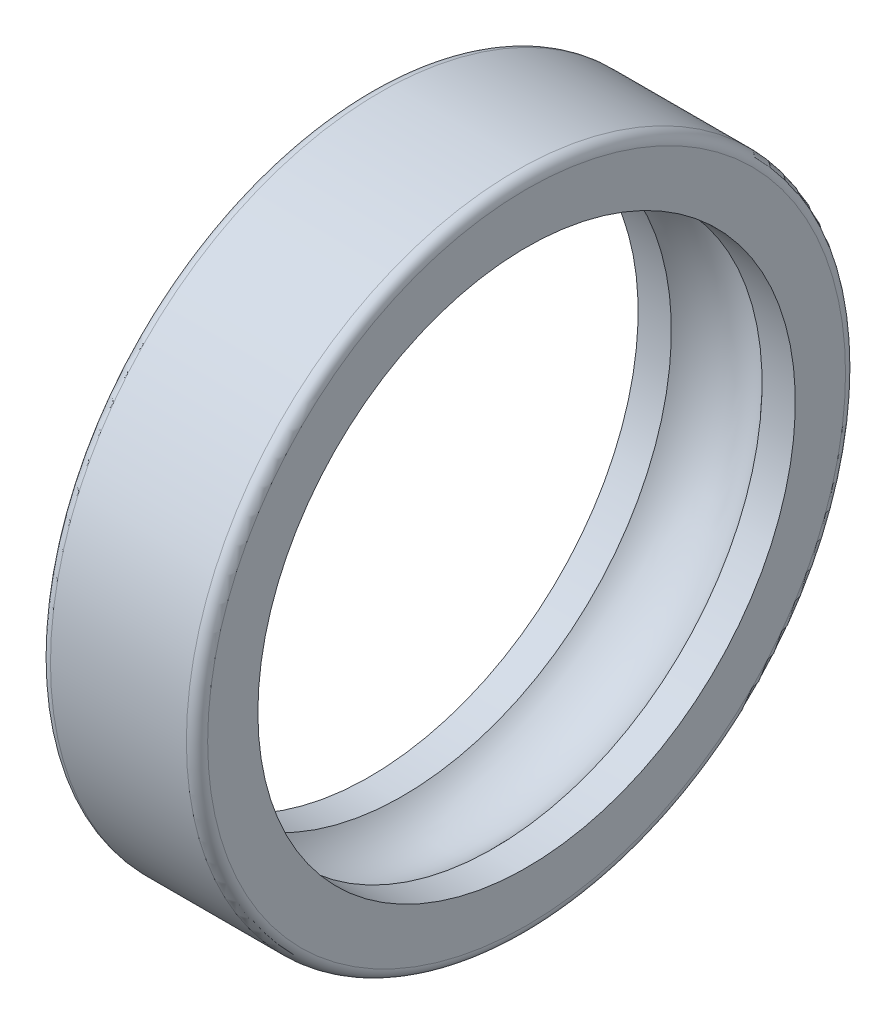
ISO-10303-21;
HEADER;
FILE_DESCRIPTION(('STEP AP214'),'2;1');
FILE_NAME('part.step','',(''),(''),'','','');
FILE_SCHEMA(('AUTOMOTIVE_DESIGN { 1 0 10303 214 1 1 1 1 }'));
ENDSEC;
DATA;
#1=APPLICATION_CONTEXT('core data for automotive mechanical design processes');
#2=APPLICATION_PROTOCOL_DEFINITION('international standard','automotive_design',2000,#1);
#3=PRODUCT_CONTEXT('',#1,'mechanical');
#4=PRODUCT('Part','Part','',(#3));
#5=PRODUCT_RELATED_PRODUCT_CATEGORY('part','',(#4));
#6=PRODUCT_DEFINITION_FORMATION('','',#4);
#7=PRODUCT_DEFINITION_CONTEXT('part definition',#1,'design');
#8=PRODUCT_DEFINITION('design','',#6,#7);
#9=PRODUCT_DEFINITION_SHAPE('','',#8);
#10=(LENGTH_UNIT() NAMED_UNIT(*) SI_UNIT(.MILLI.,.METRE.));
#11=(NAMED_UNIT(*) PLANE_ANGLE_UNIT() SI_UNIT($,.RADIAN.));
#12=(NAMED_UNIT(*) SI_UNIT($,.STERADIAN.) SOLID_ANGLE_UNIT());
#13=UNCERTAINTY_MEASURE_WITH_UNIT(LENGTH_MEASURE(1.E-05),#10,'distance_accuracy_value','');
#14=(GEOMETRIC_REPRESENTATION_CONTEXT(3) GLOBAL_UNCERTAINTY_ASSIGNED_CONTEXT((#13)) GLOBAL_UNIT_ASSIGNED_CONTEXT((#10,
#11,#12)) REPRESENTATION_CONTEXT('',''));
#15=CARTESIAN_POINT('',(0.,0.,0.));
#16=DIRECTION('',(0.,0.,1.));
#17=DIRECTION('',(1.,0.,0.));
#18=AXIS2_PLACEMENT_3D('',#15,#16,#17);
#19=CARTESIAN_POINT('',(-33.1550539901604,0.,0.));
#20=DIRECTION('',(-1.,0.,0.));
#21=DIRECTION('',(0.,0.,1.));
#22=AXIS2_PLACEMENT_3D('',#19,#20,#21);
#23=CYLINDRICAL_SURFACE('',#22,53.);
#24=CARTESIAN_POINT('',(15.5,0.,0.));
#25=DIRECTION('',(-1.,0.,0.));
#26=DIRECTION('',(0.,0.,1.));
#27=AXIS2_PLACEMENT_3D('',#24,#25,#26);
#28=CIRCLE('',#27,53.);
#29=CARTESIAN_POINT('',(15.5,0.,53.));
#30=VERTEX_POINT('',#29);
#31=EDGE_CURVE('E73',#30,#30,#28,.T.);
#32=ORIENTED_EDGE('',*,*,#31,.F.);
#33=EDGE_LOOP('',(#32));
#34=FACE_BOUND('',#33,.T.);
#35=CARTESIAN_POINT('',(8.94427190999916,0.,0.));
#36=DIRECTION('',(-1.,0.,0.));
#37=DIRECTION('',(0.,0.,1.));
#38=AXIS2_PLACEMENT_3D('',#35,#36,#37);
#39=CIRCLE('',#38,53.);
#40=CARTESIAN_POINT('',(8.94427190999916,0.,53.));
#41=VERTEX_POINT('',#40);
#42=EDGE_CURVE('E61',#41,#41,#39,.T.);
#43=ORIENTED_EDGE('',*,*,#42,.T.);
#44=EDGE_LOOP('',(#43));
#45=FACE_BOUND('',#44,.T.);
#46=ADVANCED_FACE('F37',(#34,#45),#23,.F.);
#47=CARTESIAN_POINT('',(0.,0.,0.));
#48=DIRECTION('',(-1.,0.,0.));
#49=DIRECTION('',(0.,0.,1.));
#50=AXIS2_PLACEMENT_3D('',#47,#48,#49);
#51=TOROIDAL_SURFACE('',#50,45.,12.);
#52=ORIENTED_EDGE('',*,*,#42,.F.);
#53=EDGE_LOOP('',(#52));
#54=FACE_BOUND('',#53,.T.);
#55=CARTESIAN_POINT('',(-8.94427190999916,0.,0.));
#56=DIRECTION('',(-1.,0.,0.));
#57=DIRECTION('',(0.,0.,1.));
#58=AXIS2_PLACEMENT_3D('',#55,#56,#57);
#59=CIRCLE('',#58,53.);
#60=CARTESIAN_POINT('',(-8.94427190999916,0.,53.));
#61=VERTEX_POINT('',#60);
#62=EDGE_CURVE('E65',#61,#61,#59,.T.);
#63=ORIENTED_EDGE('',*,*,#62,.T.);
#64=EDGE_LOOP('',(#63));
#65=FACE_BOUND('',#64,.T.);
#66=ADVANCED_FACE('F82',(#54,#65),#51,.F.);
#67=CARTESIAN_POINT('',(-33.1550539901604,0.,0.));
#68=DIRECTION('',(-1.,0.,0.));
#69=DIRECTION('',(0.,0.,1.));
#70=AXIS2_PLACEMENT_3D('',#67,#68,#69);
#71=CYLINDRICAL_SURFACE('',#70,53.);
#72=ORIENTED_EDGE('',*,*,#62,.F.);
#73=EDGE_LOOP('',(#72));
#74=FACE_BOUND('',#73,.T.);
#75=CARTESIAN_POINT('',(-15.5,0.,0.));
#76=DIRECTION('',(-1.,0.,0.));
#77=DIRECTION('',(0.,0.,1.));
#78=AXIS2_PLACEMENT_3D('',#75,#76,#77);
#79=CIRCLE('',#78,53.);
#80=CARTESIAN_POINT('',(-15.5,0.,53.));
#81=VERTEX_POINT('',#80);
#82=EDGE_CURVE('E69',#81,#81,#79,.T.);
#83=ORIENTED_EDGE('',*,*,#82,.T.);
#84=EDGE_LOOP('',(#83));
#85=FACE_BOUND('',#84,.T.);
#86=ADVANCED_FACE('F88',(#74,#85),#71,.F.);
#87=CARTESIAN_POINT('',(-15.5,65.,0.));
#88=DIRECTION('',(1.,0.,0.));
#89=DIRECTION('',(0.,0.,-1.));
#90=AXIS2_PLACEMENT_3D('',#87,#88,#89);
#91=PLANE('',#90);
#92=CARTESIAN_POINT('',(-15.5,0.,0.));
#93=DIRECTION('',(1.,0.,0.));
#94=DIRECTION('',(0.,0.,-1.));
#95=AXIS2_PLACEMENT_3D('',#92,#93,#94);
#96=CIRCLE('',#95,62.9);
#97=CARTESIAN_POINT('',(-15.5,0.,-62.9));
#98=VERTEX_POINT('',#97);
#99=EDGE_CURVE('E10',#98,#98,#96,.F.);
#100=ORIENTED_EDGE('',*,*,#99,.T.);
#101=EDGE_LOOP('',(#100));
#102=FACE_BOUND('',#101,.T.);
#103=ORIENTED_EDGE('',*,*,#82,.F.);
#104=EDGE_LOOP('',(#103));
#105=FACE_BOUND('',#104,.T.);
#106=ADVANCED_FACE('F94',(#102,#105),#91,.F.);
#107=CARTESIAN_POINT('',(-33.1550539901604,0.,0.));
#108=DIRECTION('',(-1.,0.,0.));
#109=DIRECTION('',(0.,0.,1.));
#110=AXIS2_PLACEMENT_3D('',#107,#108,#109);
#111=CYLINDRICAL_SURFACE('',#110,65.);
#112=CARTESIAN_POINT('',(13.4,0.,0.));
#113=DIRECTION('',(-1.,0.,0.));
#114=DIRECTION('',(0.,0.,1.));
#115=AXIS2_PLACEMENT_3D('',#112,#113,#114);
#116=CIRCLE('',#115,65.);
#117=CARTESIAN_POINT('',(13.4,0.,65.));
#118=VERTEX_POINT('',#117);
#119=EDGE_CURVE('E50',#118,#118,#116,.T.);
#120=ORIENTED_EDGE('',*,*,#119,.T.);
#121=EDGE_LOOP('',(#120));
#122=FACE_BOUND('',#121,.T.);
#123=CARTESIAN_POINT('',(-13.4,0.,0.));
#124=DIRECTION('',(1.,0.,0.));
#125=DIRECTION('',(0.,0.,-1.));
#126=AXIS2_PLACEMENT_3D('',#123,#124,#125);
#127=CIRCLE('',#126,65.);
#128=CARTESIAN_POINT('',(-13.4,0.,-65.));
#129=VERTEX_POINT('',#128);
#130=EDGE_CURVE('E55',#129,#129,#127,.T.);
#131=ORIENTED_EDGE('',*,*,#130,.T.);
#132=EDGE_LOOP('',(#131));
#133=FACE_BOUND('',#132,.T.);
#134=ADVANCED_FACE('F99',(#122,#133),#111,.T.);
#135=CARTESIAN_POINT('',(15.5,65.,0.));
#136=DIRECTION('',(-1.,0.,0.));
#137=DIRECTION('',(0.,0.,1.));
#138=AXIS2_PLACEMENT_3D('',#135,#136,#137);
#139=PLANE('',#138);
#140=CARTESIAN_POINT('',(15.5,0.,0.));
#141=DIRECTION('',(-1.,0.,0.));
#142=DIRECTION('',(0.,0.,1.));
#143=AXIS2_PLACEMENT_3D('',#140,#141,#142);
#144=CIRCLE('',#143,62.9);
#145=CARTESIAN_POINT('',(15.5,0.,62.9));
#146=VERTEX_POINT('',#145);
#147=EDGE_CURVE('E45',#146,#146,#144,.F.);
#148=ORIENTED_EDGE('',*,*,#147,.T.);
#149=EDGE_LOOP('',(#148));
#150=FACE_BOUND('',#149,.T.);
#151=ORIENTED_EDGE('',*,*,#31,.T.);
#152=EDGE_LOOP('',(#151));
#153=FACE_BOUND('',#152,.T.);
#154=ADVANCED_FACE('F78',(#150,#153),#139,.F.);
#155=CARTESIAN_POINT('',(13.4,0.,0.));
#156=DIRECTION('',(-1.,0.,0.));
#157=DIRECTION('',(0.,0.,1.));
#158=AXIS2_PLACEMENT_3D('',#155,#156,#157);
#159=TOROIDAL_SURFACE('',#158,62.9,2.1);
#160=ORIENTED_EDGE('',*,*,#147,.F.);
#161=EDGE_LOOP('',(#160));
#162=FACE_BOUND('',#161,.T.);
#163=ORIENTED_EDGE('',*,*,#119,.F.);
#164=EDGE_LOOP('',(#163));
#165=FACE_BOUND('',#164,.T.);
#166=ADVANCED_FACE('F107',(#162,#165),#159,.T.);
#167=CARTESIAN_POINT('',(-13.4,0.,0.));
#168=DIRECTION('',(1.,0.,0.));
#169=DIRECTION('',(0.,0.,-1.));
#170=AXIS2_PLACEMENT_3D('',#167,#168,#169);
#171=TOROIDAL_SURFACE('',#170,62.9,2.1);
#172=ORIENTED_EDGE('',*,*,#130,.F.);
#173=EDGE_LOOP('',(#172));
#174=FACE_BOUND('',#173,.T.);
#175=ORIENTED_EDGE('',*,*,#99,.F.);
#176=EDGE_LOOP('',(#175));
#177=FACE_BOUND('',#176,.T.);
#178=ADVANCED_FACE('F39',(#174,#177),#171,.T.);
#179=CLOSED_SHELL('',(#46,#66,#86,#106,#134,#154,#166,#178));
#180=MANIFOLD_SOLID_BREP('B2',#179);
#181=ADVANCED_BREP_SHAPE_REPRESENTATION('',(#18,#180),#14);
#182=SHAPE_DEFINITION_REPRESENTATION(#9,#181);
ENDSEC;
END-ISO-10303-21;
